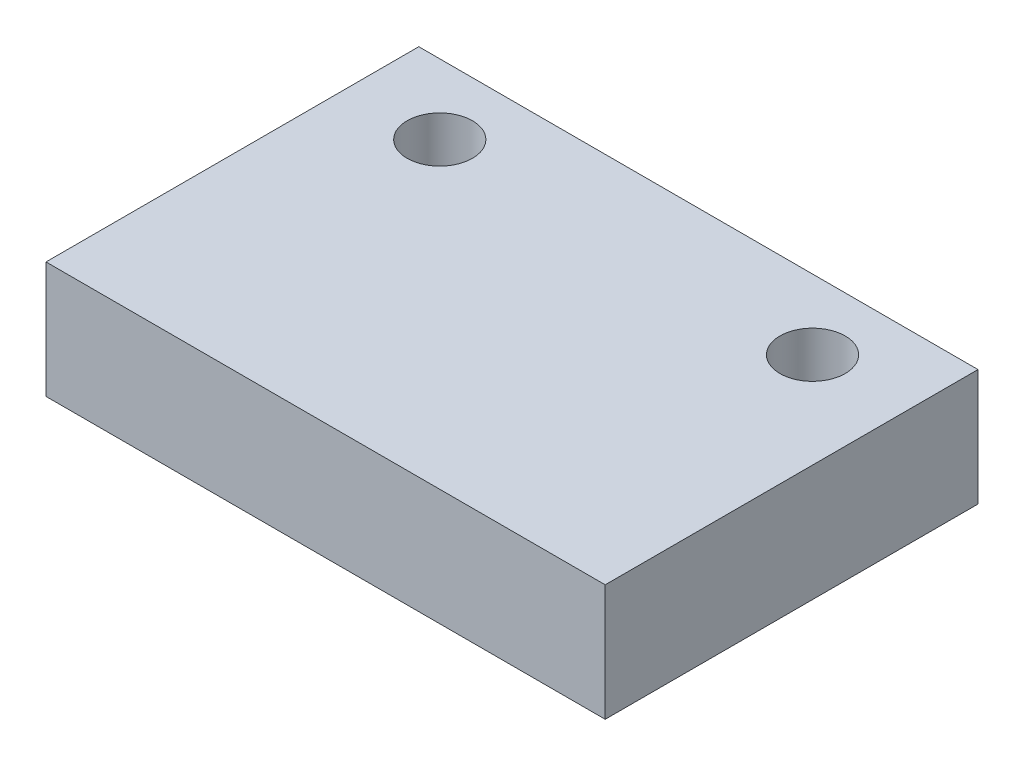
ISO-10303-21;
HEADER;
FILE_DESCRIPTION(('STEP AP214'),'2;1');
FILE_NAME('part.step','',(''),(''),'','','');
FILE_SCHEMA(('AUTOMOTIVE_DESIGN { 1 0 10303 214 1 1 1 1 }'));
ENDSEC;
DATA;
#1=APPLICATION_CONTEXT('core data for automotive mechanical design processes');
#2=APPLICATION_PROTOCOL_DEFINITION('international standard','automotive_design',2000,#1);
#3=PRODUCT_CONTEXT('',#1,'mechanical');
#4=PRODUCT('Part','Part','',(#3));
#5=PRODUCT_RELATED_PRODUCT_CATEGORY('part','',(#4));
#6=PRODUCT_DEFINITION_FORMATION('','',#4);
#7=PRODUCT_DEFINITION_CONTEXT('part definition',#1,'design');
#8=PRODUCT_DEFINITION('design','',#6,#7);
#9=PRODUCT_DEFINITION_SHAPE('','',#8);
#10=(LENGTH_UNIT() NAMED_UNIT(*) SI_UNIT(.MILLI.,.METRE.));
#11=(NAMED_UNIT(*) PLANE_ANGLE_UNIT() SI_UNIT($,.RADIAN.));
#12=(NAMED_UNIT(*) SI_UNIT($,.STERADIAN.) SOLID_ANGLE_UNIT());
#13=UNCERTAINTY_MEASURE_WITH_UNIT(LENGTH_MEASURE(1.E-05),#10,'distance_accuracy_value','');
#14=(GEOMETRIC_REPRESENTATION_CONTEXT(3) GLOBAL_UNCERTAINTY_ASSIGNED_CONTEXT((#13)) GLOBAL_UNIT_ASSIGNED_CONTEXT((#10,
#11,#12)) REPRESENTATION_CONTEXT('',''));
#15=CARTESIAN_POINT('',(0.,0.,0.));
#16=DIRECTION('',(0.,0.,1.));
#17=DIRECTION('',(1.,0.,0.));
#18=AXIS2_PLACEMENT_3D('',#15,#16,#17);
#19=CARTESIAN_POINT('',(0.,30.,0.));
#20=DIRECTION('',(0.,1.,0.));
#21=DIRECTION('',(0.,0.,1.));
#22=AXIS2_PLACEMENT_3D('',#19,#20,#21);
#23=PLANE('',#22);
#24=CARTESIAN_POINT('',(-40.5,30.,-25.));
#25=DIRECTION('',(0.,1.,0.));
#26=DIRECTION('',(0.,0.,1.));
#27=AXIS2_PLACEMENT_3D('',#24,#25,#26);
#28=CIRCLE('',#27,7.);
#29=CARTESIAN_POINT('',(-40.5,30.,-18.));
#30=VERTEX_POINT('',#29);
#31=EDGE_CURVE('E83',#30,#30,#28,.F.);
#32=ORIENTED_EDGE('',*,*,#31,.T.);
#33=EDGE_LOOP('',(#32));
#34=FACE_BOUND('',#33,.T.);
#35=CARTESIAN_POINT('',(39.5,30.,-25.));
#36=DIRECTION('',(0.,-1.,0.));
#37=DIRECTION('',(0.,0.,-1.));
#38=AXIS2_PLACEMENT_3D('',#35,#36,#37);
#39=CIRCLE('',#38,7.);
#40=CARTESIAN_POINT('',(39.5,30.,-32.));
#41=VERTEX_POINT('',#40);
#42=EDGE_CURVE('E20',#41,#41,#39,.T.);
#43=ORIENTED_EDGE('',*,*,#42,.T.);
#44=EDGE_LOOP('',(#43));
#45=FACE_BOUND('',#44,.T.);
#46=DIRECTION('',(-1.,0.,0.));
#47=VECTOR('',#46,1.);
#48=CARTESIAN_POINT('',(60.,30.,-40.));
#49=LINE('',#48,#47);
#50=CARTESIAN_POINT('',(-60.,30.,-40.));
#51=VERTEX_POINT('',#50);
#52=CARTESIAN_POINT('',(60.,30.,-40.));
#53=VERTEX_POINT('',#52);
#54=EDGE_CURVE('E60',#51,#53,#49,.F.);
#55=ORIENTED_EDGE('',*,*,#54,.F.);
#56=DIRECTION('',(0.,0.,1.));
#57=VECTOR('',#56,1.);
#58=CARTESIAN_POINT('',(-60.,30.,-40.));
#59=LINE('',#58,#57);
#60=CARTESIAN_POINT('',(-60.,30.,40.));
#61=VERTEX_POINT('',#60);
#62=EDGE_CURVE('E92',#61,#51,#59,.F.);
#63=ORIENTED_EDGE('',*,*,#62,.F.);
#64=DIRECTION('',(1.,0.,0.));
#65=VECTOR('',#64,1.);
#66=CARTESIAN_POINT('',(-60.,30.,40.));
#67=LINE('',#66,#65);
#68=CARTESIAN_POINT('',(60.,30.,40.));
#69=VERTEX_POINT('',#68);
#70=EDGE_CURVE('E70',#69,#61,#67,.F.);
#71=ORIENTED_EDGE('',*,*,#70,.F.);
#72=DIRECTION('',(0.,0.,-1.));
#73=VECTOR('',#72,1.);
#74=CARTESIAN_POINT('',(60.,30.,40.));
#75=LINE('',#74,#73);
#76=EDGE_CURVE('E55',#53,#69,#75,.F.);
#77=ORIENTED_EDGE('',*,*,#76,.F.);
#78=EDGE_LOOP('',(#55,#63,#71,#77));
#79=FACE_BOUND('',#78,.T.);
#80=ADVANCED_FACE('F17',(#34,#45,#79),#23,.T.);
#81=CARTESIAN_POINT('',(60.,0.,-40.));
#82=DIRECTION('',(0.,0.,-1.));
#83=DIRECTION('',(-1.,0.,0.));
#84=AXIS2_PLACEMENT_3D('',#81,#82,#83);
#85=PLANE('',#84);
#86=DIRECTION('',(0.,1.,0.));
#87=VECTOR('',#86,1.);
#88=CARTESIAN_POINT('',(60.,0.,-40.));
#89=LINE('',#88,#87);
#90=CARTESIAN_POINT('',(60.,5.,-40.));
#91=VERTEX_POINT('',#90);
#92=EDGE_CURVE('E62',#91,#53,#89,.T.);
#93=ORIENTED_EDGE('',*,*,#92,.F.);
#94=DIRECTION('',(1.,0.,0.));
#95=VECTOR('',#94,1.);
#96=CARTESIAN_POINT('',(-0.5,5.,-40.));
#97=LINE('',#96,#95);
#98=CARTESIAN_POINT('',(-60.,5.,-40.));
#99=VERTEX_POINT('',#98);
#100=EDGE_CURVE('E85',#99,#91,#97,.T.);
#101=ORIENTED_EDGE('',*,*,#100,.F.);
#102=DIRECTION('',(0.,1.,0.));
#103=VECTOR('',#102,1.);
#104=CARTESIAN_POINT('',(-60.,0.,-40.));
#105=LINE('',#104,#103);
#106=EDGE_CURVE('E65',#51,#99,#105,.F.);
#107=ORIENTED_EDGE('',*,*,#106,.F.);
#108=ORIENTED_EDGE('',*,*,#54,.T.);
#109=EDGE_LOOP('',(#93,#101,#107,#108));
#110=FACE_BOUND('',#109,.T.);
#111=ADVANCED_FACE('F61',(#110),#85,.T.);
#112=CARTESIAN_POINT('',(60.,0.,40.));
#113=DIRECTION('',(1.,0.,0.));
#114=DIRECTION('',(0.,0.,-1.));
#115=AXIS2_PLACEMENT_3D('',#112,#113,#114);
#116=PLANE('',#115);
#117=DIRECTION('',(0.,1.,0.));
#118=VECTOR('',#117,1.);
#119=CARTESIAN_POINT('',(60.,0.,40.));
#120=LINE('',#119,#118);
#121=CARTESIAN_POINT('',(60.,5.,40.));
#122=VERTEX_POINT('',#121);
#123=EDGE_CURVE('E72',#122,#69,#120,.T.);
#124=ORIENTED_EDGE('',*,*,#123,.F.);
#125=DIRECTION('',(0.,0.,-1.));
#126=VECTOR('',#125,1.);
#127=CARTESIAN_POINT('',(60.,5.,25.));
#128=LINE('',#127,#126);
#129=EDGE_CURVE('E76',#91,#122,#128,.F.);
#130=ORIENTED_EDGE('',*,*,#129,.F.);
#131=ORIENTED_EDGE('',*,*,#92,.T.);
#132=ORIENTED_EDGE('',*,*,#76,.T.);
#133=EDGE_LOOP('',(#124,#130,#131,#132));
#134=FACE_BOUND('',#133,.T.);
#135=ADVANCED_FACE('F74',(#134),#116,.T.);
#136=CARTESIAN_POINT('',(-60.,0.,40.));
#137=DIRECTION('',(0.,0.,1.));
#138=DIRECTION('',(1.,0.,0.));
#139=AXIS2_PLACEMENT_3D('',#136,#137,#138);
#140=PLANE('',#139);
#141=DIRECTION('',(0.,1.,0.));
#142=VECTOR('',#141,1.);
#143=CARTESIAN_POINT('',(-60.,0.,40.));
#144=LINE('',#143,#142);
#145=CARTESIAN_POINT('',(-60.,5.,40.));
#146=VERTEX_POINT('',#145);
#147=EDGE_CURVE('E35',#146,#61,#144,.T.);
#148=ORIENTED_EDGE('',*,*,#147,.F.);
#149=DIRECTION('',(1.,0.,0.));
#150=VECTOR('',#149,1.);
#151=CARTESIAN_POINT('',(-0.5,5.,40.));
#152=LINE('',#151,#150);
#153=EDGE_CURVE('E102',#122,#146,#152,.F.);
#154=ORIENTED_EDGE('',*,*,#153,.F.);
#155=ORIENTED_EDGE('',*,*,#123,.T.);
#156=ORIENTED_EDGE('',*,*,#70,.T.);
#157=EDGE_LOOP('',(#148,#154,#155,#156));
#158=FACE_BOUND('',#157,.T.);
#159=ADVANCED_FACE('F100',(#158),#140,.T.);
#160=CARTESIAN_POINT('',(-60.,0.,-40.));
#161=DIRECTION('',(-1.,0.,0.));
#162=DIRECTION('',(0.,0.,1.));
#163=AXIS2_PLACEMENT_3D('',#160,#161,#162);
#164=PLANE('',#163);
#165=ORIENTED_EDGE('',*,*,#106,.T.);
#166=DIRECTION('',(0.,0.,-1.));
#167=VECTOR('',#166,1.);
#168=CARTESIAN_POINT('',(-60.,5.,25.));
#169=LINE('',#168,#167);
#170=EDGE_CURVE('E82',#146,#99,#169,.T.);
#171=ORIENTED_EDGE('',*,*,#170,.F.);
#172=ORIENTED_EDGE('',*,*,#147,.T.);
#173=ORIENTED_EDGE('',*,*,#62,.T.);
#174=EDGE_LOOP('',(#165,#171,#172,#173));
#175=FACE_BOUND('',#174,.T.);
#176=ADVANCED_FACE('F107',(#175),#164,.T.);
#177=CARTESIAN_POINT('',(39.5,48.5163255499,-25.));
#178=DIRECTION('',(0.,-1.,0.));
#179=DIRECTION('',(0.,0.,-1.));
#180=AXIS2_PLACEMENT_3D('',#177,#178,#179);
#181=CYLINDRICAL_SURFACE('',#180,7.);
#182=ORIENTED_EDGE('',*,*,#42,.F.);
#183=EDGE_LOOP('',(#182));
#184=FACE_BOUND('',#183,.T.);
#185=CARTESIAN_POINT('',(39.5,5.,-25.));
#186=DIRECTION('',(0.,-1.,0.));
#187=DIRECTION('',(0.,0.,-1.));
#188=AXIS2_PLACEMENT_3D('',#185,#186,#187);
#189=CIRCLE('',#188,7.);
#190=CARTESIAN_POINT('',(39.5,5.,-32.));
#191=VERTEX_POINT('',#190);
#192=EDGE_CURVE('E26',#191,#191,#189,.F.);
#193=ORIENTED_EDGE('',*,*,#192,.F.);
#194=EDGE_LOOP('',(#193));
#195=FACE_BOUND('',#194,.T.);
#196=ADVANCED_FACE('F109',(#184,#195),#181,.F.);
#197=CARTESIAN_POINT('',(-40.5,48.5163255499,-25.));
#198=DIRECTION('',(0.,1.,0.));
#199=DIRECTION('',(0.,0.,1.));
#200=AXIS2_PLACEMENT_3D('',#197,#198,#199);
#201=CYLINDRICAL_SURFACE('',#200,7.);
#202=ORIENTED_EDGE('',*,*,#31,.F.);
#203=EDGE_LOOP('',(#202));
#204=FACE_BOUND('',#203,.T.);
#205=CARTESIAN_POINT('',(-40.5,5.,-25.));
#206=DIRECTION('',(0.,1.,0.));
#207=DIRECTION('',(0.,0.,1.));
#208=AXIS2_PLACEMENT_3D('',#205,#206,#207);
#209=CIRCLE('',#208,7.);
#210=CARTESIAN_POINT('',(-40.5,5.,-18.));
#211=VERTEX_POINT('',#210);
#212=EDGE_CURVE('E11',#211,#211,#209,.T.);
#213=ORIENTED_EDGE('',*,*,#212,.F.);
#214=EDGE_LOOP('',(#213));
#215=FACE_BOUND('',#214,.T.);
#216=ADVANCED_FACE('F116',(#204,#215),#201,.F.);
#217=CARTESIAN_POINT('',(-0.5,5.,25.));
#218=DIRECTION('',(0.,-1.,0.));
#219=DIRECTION('',(0.,0.,-1.));
#220=AXIS2_PLACEMENT_3D('',#217,#218,#219);
#221=PLANE('',#220);
#222=ORIENTED_EDGE('',*,*,#212,.T.);
#223=EDGE_LOOP('',(#222));
#224=FACE_BOUND('',#223,.T.);
#225=ORIENTED_EDGE('',*,*,#192,.T.);
#226=EDGE_LOOP('',(#225));
#227=FACE_BOUND('',#226,.T.);
#228=ORIENTED_EDGE('',*,*,#153,.T.);
#229=ORIENTED_EDGE('',*,*,#170,.T.);
#230=ORIENTED_EDGE('',*,*,#100,.T.);
#231=ORIENTED_EDGE('',*,*,#129,.T.);
#232=EDGE_LOOP('',(#228,#229,#230,#231));
#233=FACE_BOUND('',#232,.T.);
#234=ADVANCED_FACE('F105',(#224,#227,#233),#221,.T.);
#235=CLOSED_SHELL('',(#80,#111,#135,#159,#176,#196,#216,#234));
#236=MANIFOLD_SOLID_BREP('B1',#235);
#237=ADVANCED_BREP_SHAPE_REPRESENTATION('',(#18,#236),#14);
#238=SHAPE_DEFINITION_REPRESENTATION(#9,#237);
ENDSEC;
END-ISO-10303-21;
